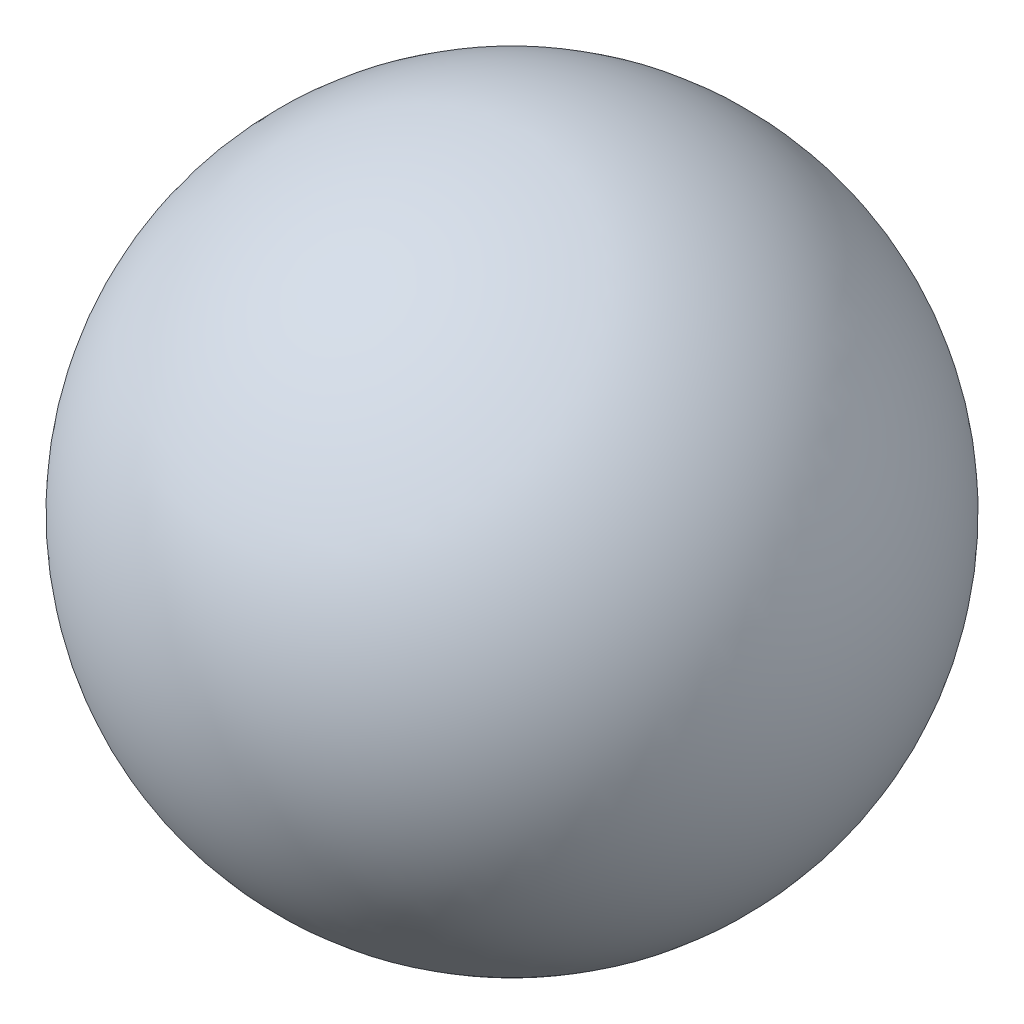
ISO-10303-21;
HEADER;
FILE_DESCRIPTION(('STEP AP214'),'2;1');
FILE_NAME('part.step','',(''),(''),'','','');
FILE_SCHEMA(('AUTOMOTIVE_DESIGN { 1 0 10303 214 1 1 1 1 }'));
ENDSEC;
DATA;
#1=APPLICATION_CONTEXT('core data for automotive mechanical design processes');
#2=APPLICATION_PROTOCOL_DEFINITION('international standard','automotive_design',2000,#1);
#3=PRODUCT_CONTEXT('',#1,'mechanical');
#4=PRODUCT('Part','Part','',(#3));
#5=PRODUCT_RELATED_PRODUCT_CATEGORY('part','',(#4));
#6=PRODUCT_DEFINITION_FORMATION('','',#4);
#7=PRODUCT_DEFINITION_CONTEXT('part definition',#1,'design');
#8=PRODUCT_DEFINITION('design','',#6,#7);
#9=PRODUCT_DEFINITION_SHAPE('','',#8);
#10=(LENGTH_UNIT() NAMED_UNIT(*) SI_UNIT(.MILLI.,.METRE.));
#11=(NAMED_UNIT(*) PLANE_ANGLE_UNIT() SI_UNIT($,.RADIAN.));
#12=(NAMED_UNIT(*) SI_UNIT($,.STERADIAN.) SOLID_ANGLE_UNIT());
#13=UNCERTAINTY_MEASURE_WITH_UNIT(LENGTH_MEASURE(1.E-05),#10,'distance_accuracy_value','');
#14=(GEOMETRIC_REPRESENTATION_CONTEXT(3) GLOBAL_UNCERTAINTY_ASSIGNED_CONTEXT((#13)) GLOBAL_UNIT_ASSIGNED_CONTEXT((#10,
#11,#12)) REPRESENTATION_CONTEXT('',''));
#15=CARTESIAN_POINT('',(0.,0.,0.));
#16=DIRECTION('',(0.,0.,1.));
#17=DIRECTION('',(1.,0.,0.));
#18=AXIS2_PLACEMENT_3D('',#15,#16,#17);
#19=CARTESIAN_POINT('',(0.,0.,-3.35));
#20=DIRECTION('',(0.0436746395810799,0.997954029736576,0.0466934726700802));
#21=DIRECTION('',(-0.990820311528116,0.0372825196496607,0.129942771987905));
#22=AXIS2_PLACEMENT_3D('',#19,#20,#21);
#23=SPHERICAL_SURFACE('',#22,0.794);
#24=CARTESIAN_POINT('',(0.0346776638273774,0.79237549961083,-3.31292538269996));
#25=VERTEX_POINT('',#24);
#26=VERTEX_LOOP('',#25);
#27=FACE_BOUND('',#26,.T.);
#28=CARTESIAN_POINT('',(-0.0346776638273775,-0.792375499610853,-3.38707461730004));
#29=VERTEX_POINT('',#28);
#30=VERTEX_LOOP('',#29);
#31=FACE_BOUND('',#30,.T.);
#32=ADVANCED_FACE('F16',(#27,#31),#23,.T.);
#33=CLOSED_SHELL('',(#32));
#34=MANIFOLD_SOLID_BREP('B1',#33);
#35=ADVANCED_BREP_SHAPE_REPRESENTATION('',(#18,#34),#14);
#36=SHAPE_DEFINITION_REPRESENTATION(#9,#35);
ENDSEC;
END-ISO-10303-21;
